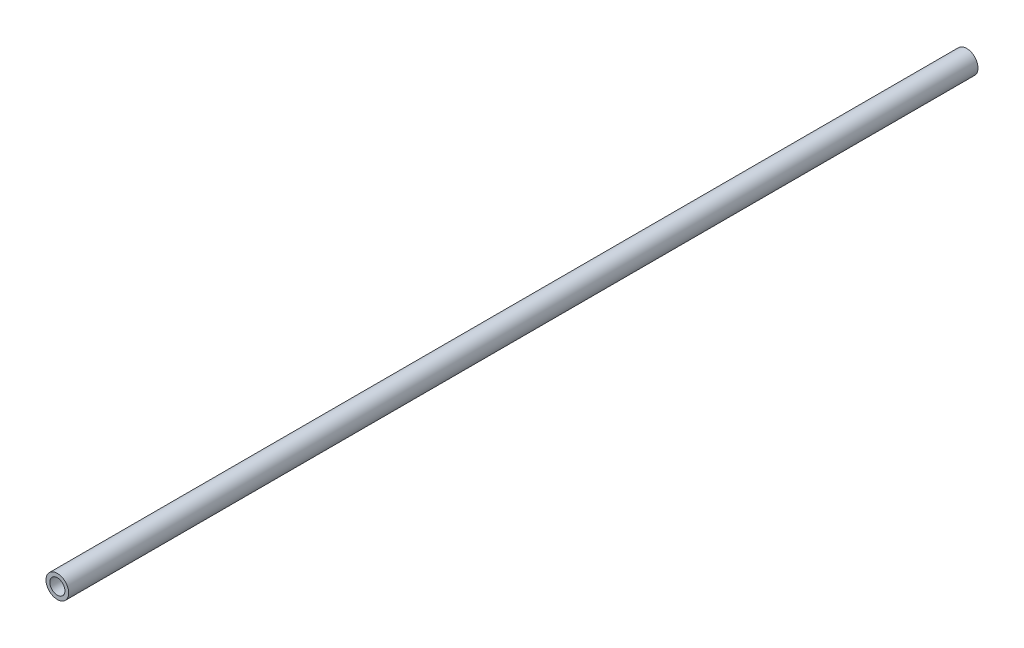
ISO-10303-21;
HEADER;
FILE_DESCRIPTION(('STEP AP214'),'2;1');
FILE_NAME('part.step','',(''),(''),'','','');
FILE_SCHEMA(('AUTOMOTIVE_DESIGN { 1 0 10303 214 1 1 1 1 }'));
ENDSEC;
DATA;
#1=APPLICATION_CONTEXT('core data for automotive mechanical design processes');
#2=APPLICATION_PROTOCOL_DEFINITION('international standard','automotive_design',2000,#1);
#3=PRODUCT_CONTEXT('',#1,'mechanical');
#4=PRODUCT('Part','Part','',(#3));
#5=PRODUCT_RELATED_PRODUCT_CATEGORY('part','',(#4));
#6=PRODUCT_DEFINITION_FORMATION('','',#4);
#7=PRODUCT_DEFINITION_CONTEXT('part definition',#1,'design');
#8=PRODUCT_DEFINITION('design','',#6,#7);
#9=PRODUCT_DEFINITION_SHAPE('','',#8);
#10=(LENGTH_UNIT() NAMED_UNIT(*) SI_UNIT(.MILLI.,.METRE.));
#11=(NAMED_UNIT(*) PLANE_ANGLE_UNIT() SI_UNIT($,.RADIAN.));
#12=(NAMED_UNIT(*) SI_UNIT($,.STERADIAN.) SOLID_ANGLE_UNIT());
#13=UNCERTAINTY_MEASURE_WITH_UNIT(LENGTH_MEASURE(1.E-05),#10,'distance_accuracy_value','');
#14=(GEOMETRIC_REPRESENTATION_CONTEXT(3) GLOBAL_UNCERTAINTY_ASSIGNED_CONTEXT((#13)) GLOBAL_UNIT_ASSIGNED_CONTEXT((#10,
#11,#12)) REPRESENTATION_CONTEXT('',''));
#15=CARTESIAN_POINT('',(0.,0.,0.));
#16=DIRECTION('',(0.,0.,1.));
#17=DIRECTION('',(1.,0.,0.));
#18=AXIS2_PLACEMENT_3D('',#15,#16,#17);
#19=CARTESIAN_POINT('',(0.,0.,609.6));
#20=DIRECTION('',(0.,0.,1.));
#21=DIRECTION('',(1.,0.,0.));
#22=AXIS2_PLACEMENT_3D('',#19,#20,#21);
#23=PLANE('',#22);
#24=CARTESIAN_POINT('',(0.,0.,609.6));
#25=DIRECTION('',(0.,0.,1.));
#26=DIRECTION('',(1.,0.,0.));
#27=AXIS2_PLACEMENT_3D('',#24,#25,#26);
#28=CIRCLE('',#27,7.62);
#29=CARTESIAN_POINT('',(7.62,0.,609.6));
#30=VERTEX_POINT('',#29);
#31=EDGE_CURVE('E12',#30,#30,#28,.T.);
#32=ORIENTED_EDGE('',*,*,#31,.T.);
#33=EDGE_LOOP('',(#32));
#34=FACE_BOUND('',#33,.T.);
#35=CARTESIAN_POINT('',(0.,0.,609.6));
#36=DIRECTION('',(0.,0.,1.));
#37=DIRECTION('',(1.,0.,0.));
#38=AXIS2_PLACEMENT_3D('',#35,#36,#37);
#39=CIRCLE('',#38,5.08);
#40=CARTESIAN_POINT('',(5.08,0.,609.6));
#41=VERTEX_POINT('',#40);
#42=EDGE_CURVE('E52',#41,#41,#39,.T.);
#43=ORIENTED_EDGE('',*,*,#42,.F.);
#44=EDGE_LOOP('',(#43));
#45=FACE_BOUND('',#44,.T.);
#46=ADVANCED_FACE('F41',(#34,#45),#23,.T.);
#47=CARTESIAN_POINT('',(0.,0.,0.));
#48=DIRECTION('',(0.,0.,1.));
#49=DIRECTION('',(1.,0.,0.));
#50=AXIS2_PLACEMENT_3D('',#47,#48,#49);
#51=PLANE('',#50);
#52=CARTESIAN_POINT('',(0.,0.,0.));
#53=DIRECTION('',(0.,0.,1.));
#54=DIRECTION('',(1.,0.,0.));
#55=AXIS2_PLACEMENT_3D('',#52,#53,#54);
#56=CIRCLE('',#55,7.62);
#57=CARTESIAN_POINT('',(7.62,0.,0.));
#58=VERTEX_POINT('',#57);
#59=EDGE_CURVE('E45',#58,#58,#56,.T.);
#60=ORIENTED_EDGE('',*,*,#59,.F.);
#61=EDGE_LOOP('',(#60));
#62=FACE_BOUND('',#61,.T.);
#63=CARTESIAN_POINT('',(0.,0.,0.));
#64=DIRECTION('',(0.,0.,1.));
#65=DIRECTION('',(1.,0.,0.));
#66=AXIS2_PLACEMENT_3D('',#63,#64,#65);
#67=CIRCLE('',#66,5.08);
#68=CARTESIAN_POINT('',(5.08,0.,0.));
#69=VERTEX_POINT('',#68);
#70=EDGE_CURVE('E54',#69,#69,#67,.T.);
#71=ORIENTED_EDGE('',*,*,#70,.T.);
#72=EDGE_LOOP('',(#71));
#73=FACE_BOUND('',#72,.T.);
#74=ADVANCED_FACE('F64',(#62,#73),#51,.F.);
#75=CARTESIAN_POINT('',(0.,0.,609.6));
#76=DIRECTION('',(0.,0.,-1.));
#77=DIRECTION('',(-1.,0.,0.));
#78=AXIS2_PLACEMENT_3D('',#75,#76,#77);
#79=CYLINDRICAL_SURFACE('',#78,7.62);
#80=ORIENTED_EDGE('',*,*,#31,.F.);
#81=EDGE_LOOP('',(#80));
#82=FACE_BOUND('',#81,.T.);
#83=ORIENTED_EDGE('',*,*,#59,.T.);
#84=EDGE_LOOP('',(#83));
#85=FACE_BOUND('',#84,.T.);
#86=ADVANCED_FACE('F43',(#82,#85),#79,.T.);
#87=CARTESIAN_POINT('',(0.,0.,609.6));
#88=DIRECTION('',(0.,0.,-1.));
#89=DIRECTION('',(-1.,0.,0.));
#90=AXIS2_PLACEMENT_3D('',#87,#88,#89);
#91=CYLINDRICAL_SURFACE('',#90,5.08);
#92=ORIENTED_EDGE('',*,*,#42,.T.);
#93=EDGE_LOOP('',(#92));
#94=FACE_BOUND('',#93,.T.);
#95=ORIENTED_EDGE('',*,*,#70,.F.);
#96=EDGE_LOOP('',(#95));
#97=FACE_BOUND('',#96,.T.);
#98=ADVANCED_FACE('F60',(#94,#97),#91,.F.);
#99=CLOSED_SHELL('',(#46,#74,#86,#98));
#100=MANIFOLD_SOLID_BREP('B2',#99);
#101=ADVANCED_BREP_SHAPE_REPRESENTATION('',(#18,#100),#14);
#102=SHAPE_DEFINITION_REPRESENTATION(#9,#101);
ENDSEC;
END-ISO-10303-21;
